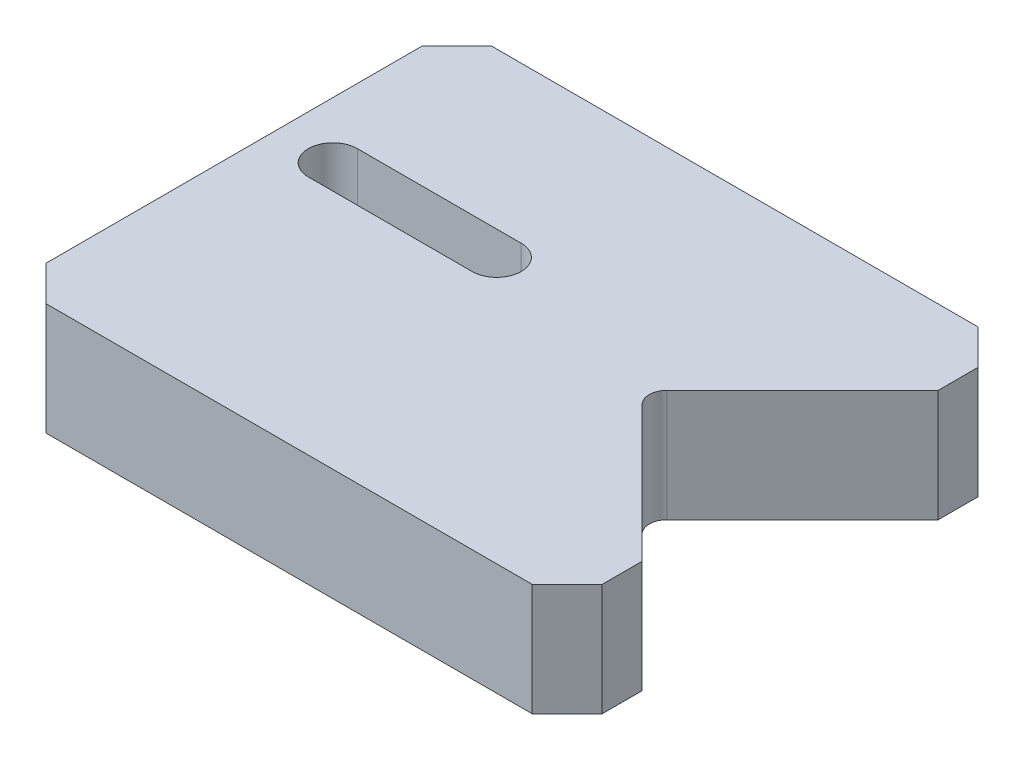
ISO-10303-21;
HEADER;
FILE_DESCRIPTION(('STEP AP214'),'2;1');
FILE_NAME('part.step','',(''),(''),'','','');
FILE_SCHEMA(('AUTOMOTIVE_DESIGN { 1 0 10303 214 1 1 1 1 }'));
ENDSEC;
DATA;
#1=APPLICATION_CONTEXT('core data for automotive mechanical design processes');
#2=APPLICATION_PROTOCOL_DEFINITION('international standard','automotive_design',2000,#1);
#3=PRODUCT_CONTEXT('',#1,'mechanical');
#4=PRODUCT('Part','Part','',(#3));
#5=PRODUCT_RELATED_PRODUCT_CATEGORY('part','',(#4));
#6=PRODUCT_DEFINITION_FORMATION('','',#4);
#7=PRODUCT_DEFINITION_CONTEXT('part definition',#1,'design');
#8=PRODUCT_DEFINITION('design','',#6,#7);
#9=PRODUCT_DEFINITION_SHAPE('','',#8);
#10=(LENGTH_UNIT() NAMED_UNIT(*) SI_UNIT(.MILLI.,.METRE.));
#11=(NAMED_UNIT(*) PLANE_ANGLE_UNIT() SI_UNIT($,.RADIAN.));
#12=(NAMED_UNIT(*) SI_UNIT($,.STERADIAN.) SOLID_ANGLE_UNIT());
#13=UNCERTAINTY_MEASURE_WITH_UNIT(LENGTH_MEASURE(1.E-05),#10,'distance_accuracy_value','');
#14=(GEOMETRIC_REPRESENTATION_CONTEXT(3) GLOBAL_UNCERTAINTY_ASSIGNED_CONTEXT((#13)) GLOBAL_UNIT_ASSIGNED_CONTEXT((#10,
#11,#12)) REPRESENTATION_CONTEXT('',''));
#15=CARTESIAN_POINT('',(0.,0.,0.));
#16=DIRECTION('',(0.,0.,1.));
#17=DIRECTION('',(1.,0.,0.));
#18=AXIS2_PLACEMENT_3D('',#15,#16,#17);
#19=CARTESIAN_POINT('',(17.6784271247462,12.8,0.));
#20=DIRECTION('',(0.,-1.,0.));
#21=DIRECTION('',(0.,0.,-1.));
#22=AXIS2_PLACEMENT_3D('',#19,#20,#21);
#23=PLANE('',#22);
#24=DIRECTION('',(0.707106781186546,0.,-0.707106781186549));
#25=VECTOR('',#24,1.);
#26=CARTESIAN_POINT('',(16.2642135623731,12.8,-1.41421356237312));
#27=LINE('',#26,#25);
#28=CARTESIAN_POINT('',(16.2642135623731,12.8,-1.41421356237311));
#29=VERTEX_POINT('',#28);
#30=CARTESIAN_POINT('',(31.75,12.8,-16.9000000000001));
#31=VERTEX_POINT('',#30);
#32=EDGE_CURVE('E182',#29,#31,#27,.T.);
#33=ORIENTED_EDGE('',*,*,#32,.T.);
#34=DIRECTION('',(0.,0.,-1.));
#35=VECTOR('',#34,1.);
#36=CARTESIAN_POINT('',(31.75,12.8,-21.45));
#37=LINE('',#36,#35);
#38=CARTESIAN_POINT('',(31.75,12.8,-21.45));
#39=VERTEX_POINT('',#38);
#40=EDGE_CURVE('E185',#31,#39,#37,.T.);
#41=ORIENTED_EDGE('',*,*,#40,.T.);
#42=DIRECTION('',(-0.707106781186548,0.,-0.707106781186548));
#43=VECTOR('',#42,1.);
#44=CARTESIAN_POINT('',(27.75,12.8,-25.45));
#45=LINE('',#44,#43);
#46=CARTESIAN_POINT('',(27.75,12.8,-25.45));
#47=VERTEX_POINT('',#46);
#48=EDGE_CURVE('E188',#39,#47,#45,.T.);
#49=ORIENTED_EDGE('',*,*,#48,.T.);
#50=DIRECTION('',(-1.,0.,0.));
#51=VECTOR('',#50,1.);
#52=CARTESIAN_POINT('',(-27.75,12.8,-25.45));
#53=LINE('',#52,#51);
#54=CARTESIAN_POINT('',(-27.75,12.8,-25.45));
#55=VERTEX_POINT('',#54);
#56=EDGE_CURVE('E190',#47,#55,#53,.T.);
#57=ORIENTED_EDGE('',*,*,#56,.T.);
#58=DIRECTION('',(-0.707106781186548,0.,0.707106781186548));
#59=VECTOR('',#58,1.);
#60=CARTESIAN_POINT('',(-31.75,12.8,-21.45));
#61=LINE('',#60,#59);
#62=CARTESIAN_POINT('',(-31.75,12.8,-21.45));
#63=VERTEX_POINT('',#62);
#64=EDGE_CURVE('E192',#55,#63,#61,.T.);
#65=ORIENTED_EDGE('',*,*,#64,.T.);
#66=DIRECTION('',(0.,0.,1.));
#67=VECTOR('',#66,1.);
#68=CARTESIAN_POINT('',(-31.75,12.8,-21.45));
#69=LINE('',#68,#67);
#70=CARTESIAN_POINT('',(-31.75,12.8,21.45));
#71=VERTEX_POINT('',#70);
#72=EDGE_CURVE('E194',#63,#71,#69,.T.);
#73=ORIENTED_EDGE('',*,*,#72,.T.);
#74=DIRECTION('',(0.707106781186548,0.,0.707106781186548));
#75=VECTOR('',#74,1.);
#76=CARTESIAN_POINT('',(-31.75,12.8,21.45));
#77=LINE('',#76,#75);
#78=CARTESIAN_POINT('',(-27.75,12.8,25.45));
#79=VERTEX_POINT('',#78);
#80=EDGE_CURVE('E196',#71,#79,#77,.T.);
#81=ORIENTED_EDGE('',*,*,#80,.T.);
#82=DIRECTION('',(1.,0.,0.));
#83=VECTOR('',#82,1.);
#84=CARTESIAN_POINT('',(-27.75,12.8,25.45));
#85=LINE('',#84,#83);
#86=CARTESIAN_POINT('',(27.75,12.8,25.45));
#87=VERTEX_POINT('',#86);
#88=EDGE_CURVE('E198',#79,#87,#85,.T.);
#89=ORIENTED_EDGE('',*,*,#88,.T.);
#90=DIRECTION('',(0.707106781186548,0.,-0.707106781186548));
#91=VECTOR('',#90,1.);
#92=CARTESIAN_POINT('',(27.75,12.8,25.45));
#93=LINE('',#92,#91);
#94=CARTESIAN_POINT('',(31.75,12.8,21.45));
#95=VERTEX_POINT('',#94);
#96=EDGE_CURVE('E200',#87,#95,#93,.T.);
#97=ORIENTED_EDGE('',*,*,#96,.T.);
#98=DIRECTION('',(0.,0.,-1.));
#99=VECTOR('',#98,1.);
#100=CARTESIAN_POINT('',(31.75,12.8,16.8999999999996));
#101=LINE('',#100,#99);
#102=CARTESIAN_POINT('',(31.75,12.8,16.8999999999996));
#103=VERTEX_POINT('',#102);
#104=EDGE_CURVE('E202',#95,#103,#101,.T.);
#105=ORIENTED_EDGE('',*,*,#104,.T.);
#106=DIRECTION('',(-0.707106781186557,0.,-0.707106781186539));
#107=VECTOR('',#106,1.);
#108=CARTESIAN_POINT('',(16.2642135623731,12.8,1.41421356237309));
#109=LINE('',#108,#107);
#110=CARTESIAN_POINT('',(16.2642135623731,12.8,1.41421356237309));
#111=VERTEX_POINT('',#110);
#112=EDGE_CURVE('E204',#103,#111,#109,.T.);
#113=ORIENTED_EDGE('',*,*,#112,.T.);
#114=CARTESIAN_POINT('',(17.6784271247462,12.8,0.));
#115=DIRECTION('',(0.,-1.,0.));
#116=DIRECTION('',(0.,0.,-1.));
#117=AXIS2_PLACEMENT_3D('',#114,#115,#116);
#118=CIRCLE('',#117,2.);
#119=EDGE_CURVE('E206',#111,#29,#118,.T.);
#120=ORIENTED_EDGE('',*,*,#119,.T.);
#121=EDGE_LOOP('',(#33,#41,#49,#57,#65,#73,#81,#89,#97,#105,#113,#120));
#122=FACE_BOUND('',#121,.T.);
#123=CARTESIAN_POINT('',(-25.3,12.8,-4.85));
#124=DIRECTION('',(0.,1.,0.));
#125=DIRECTION('',(0.,0.,1.));
#126=AXIS2_PLACEMENT_3D('',#123,#124,#125);
#127=CIRCLE('',#126,2.80000000000001);
#128=CARTESIAN_POINT('',(-25.3,12.8,-7.65000000000001));
#129=VERTEX_POINT('',#128);
#130=CARTESIAN_POINT('',(-25.3,12.8,-2.04999999999999));
#131=VERTEX_POINT('',#130);
#132=EDGE_CURVE('E146',#129,#131,#127,.T.);
#133=ORIENTED_EDGE('',*,*,#132,.F.);
#134=DIRECTION('',(-1.,0.,0.));
#135=VECTOR('',#134,1.);
#136=CARTESIAN_POINT('',(-25.3,12.8,-7.65000000000001));
#137=LINE('',#136,#135);
#138=CARTESIAN_POINT('',(-6.59999999999999,12.8,-7.65000000000001));
#139=VERTEX_POINT('',#138);
#140=EDGE_CURVE('E168',#139,#129,#137,.T.);
#141=ORIENTED_EDGE('',*,*,#140,.F.);
#142=CARTESIAN_POINT('',(-6.59999999999999,12.8,-4.85));
#143=DIRECTION('',(0.,1.,0.));
#144=DIRECTION('',(0.,0.,1.));
#145=AXIS2_PLACEMENT_3D('',#142,#143,#144);
#146=CIRCLE('',#145,2.80000000000001);
#147=CARTESIAN_POINT('',(-6.59999999999999,12.8,-2.04999999999999));
#148=VERTEX_POINT('',#147);
#149=EDGE_CURVE('E166',#148,#139,#146,.T.);
#150=ORIENTED_EDGE('',*,*,#149,.F.);
#151=DIRECTION('',(1.,0.,0.));
#152=VECTOR('',#151,1.);
#153=CARTESIAN_POINT('',(-25.3,12.8,-2.04999999999999));
#154=LINE('',#153,#152);
#155=EDGE_CURVE('E154',#131,#148,#154,.T.);
#156=ORIENTED_EDGE('',*,*,#155,.F.);
#157=EDGE_LOOP('',(#133,#141,#150,#156));
#158=FACE_BOUND('',#157,.T.);
#159=ADVANCED_FACE('F33',(#122,#158),#23,.F.);
#160=CARTESIAN_POINT('',(17.6784271247462,0.,0.));
#161=DIRECTION('',(0.,-1.,0.));
#162=DIRECTION('',(0.,0.,-1.));
#163=AXIS2_PLACEMENT_3D('',#160,#161,#162);
#164=PLANE('',#163);
#165=DIRECTION('',(0.707106781186546,0.,-0.707106781186549));
#166=VECTOR('',#165,1.);
#167=CARTESIAN_POINT('',(16.2642135623731,0.,-1.41421356237312));
#168=LINE('',#167,#166);
#169=CARTESIAN_POINT('',(16.2642135623731,0.,-1.41421356237311));
#170=VERTEX_POINT('',#169);
#171=CARTESIAN_POINT('',(31.75,0.,-16.9000000000001));
#172=VERTEX_POINT('',#171);
#173=EDGE_CURVE('E162',#170,#172,#168,.T.);
#174=ORIENTED_EDGE('',*,*,#173,.F.);
#175=CARTESIAN_POINT('',(17.6784271247462,0.,0.));
#176=DIRECTION('',(0.,-1.,0.));
#177=DIRECTION('',(0.,0.,-1.));
#178=AXIS2_PLACEMENT_3D('',#175,#176,#177);
#179=CIRCLE('',#178,2.);
#180=CARTESIAN_POINT('',(16.2642135623731,0.,1.41421356237309));
#181=VERTEX_POINT('',#180);
#182=EDGE_CURVE('E186',#181,#170,#179,.T.);
#183=ORIENTED_EDGE('',*,*,#182,.F.);
#184=DIRECTION('',(-0.707106781186557,0.,-0.707106781186539));
#185=VECTOR('',#184,1.);
#186=CARTESIAN_POINT('',(16.2642135623731,0.,1.41421356237309));
#187=LINE('',#186,#185);
#188=CARTESIAN_POINT('',(31.75,0.,16.8999999999996));
#189=VERTEX_POINT('',#188);
#190=EDGE_CURVE('E229',#189,#181,#187,.T.);
#191=ORIENTED_EDGE('',*,*,#190,.F.);
#192=DIRECTION('',(0.,0.,-1.));
#193=VECTOR('',#192,1.);
#194=CARTESIAN_POINT('',(31.75,0.,16.8999999999996));
#195=LINE('',#194,#193);
#196=CARTESIAN_POINT('',(31.75,0.,21.45));
#197=VERTEX_POINT('',#196);
#198=EDGE_CURVE('E227',#197,#189,#195,.T.);
#199=ORIENTED_EDGE('',*,*,#198,.F.);
#200=DIRECTION('',(0.707106781186548,0.,-0.707106781186548));
#201=VECTOR('',#200,1.);
#202=CARTESIAN_POINT('',(27.75,0.,25.45));
#203=LINE('',#202,#201);
#204=CARTESIAN_POINT('',(27.75,0.,25.45));
#205=VERTEX_POINT('',#204);
#206=EDGE_CURVE('E225',#205,#197,#203,.T.);
#207=ORIENTED_EDGE('',*,*,#206,.F.);
#208=DIRECTION('',(1.,0.,0.));
#209=VECTOR('',#208,1.);
#210=CARTESIAN_POINT('',(-27.75,0.,25.45));
#211=LINE('',#210,#209);
#212=CARTESIAN_POINT('',(-27.75,0.,25.45));
#213=VERTEX_POINT('',#212);
#214=EDGE_CURVE('E223',#213,#205,#211,.T.);
#215=ORIENTED_EDGE('',*,*,#214,.F.);
#216=DIRECTION('',(0.707106781186548,0.,0.707106781186548));
#217=VECTOR('',#216,1.);
#218=CARTESIAN_POINT('',(-31.75,0.,21.45));
#219=LINE('',#218,#217);
#220=CARTESIAN_POINT('',(-31.75,0.,21.45));
#221=VERTEX_POINT('',#220);
#222=EDGE_CURVE('E221',#221,#213,#219,.T.);
#223=ORIENTED_EDGE('',*,*,#222,.F.);
#224=DIRECTION('',(0.,0.,1.));
#225=VECTOR('',#224,1.);
#226=CARTESIAN_POINT('',(-31.75,0.,-21.45));
#227=LINE('',#226,#225);
#228=CARTESIAN_POINT('',(-31.75,0.,-21.45));
#229=VERTEX_POINT('',#228);
#230=EDGE_CURVE('E219',#229,#221,#227,.T.);
#231=ORIENTED_EDGE('',*,*,#230,.F.);
#232=DIRECTION('',(-0.707106781186548,0.,0.707106781186548));
#233=VECTOR('',#232,1.);
#234=CARTESIAN_POINT('',(-31.75,0.,-21.45));
#235=LINE('',#234,#233);
#236=CARTESIAN_POINT('',(-27.75,0.,-25.45));
#237=VERTEX_POINT('',#236);
#238=EDGE_CURVE('E217',#237,#229,#235,.T.);
#239=ORIENTED_EDGE('',*,*,#238,.F.);
#240=DIRECTION('',(-1.,0.,0.));
#241=VECTOR('',#240,1.);
#242=CARTESIAN_POINT('',(-27.75,0.,-25.45));
#243=LINE('',#242,#241);
#244=CARTESIAN_POINT('',(27.75,0.,-25.45));
#245=VERTEX_POINT('',#244);
#246=EDGE_CURVE('E215',#245,#237,#243,.T.);
#247=ORIENTED_EDGE('',*,*,#246,.F.);
#248=DIRECTION('',(-0.707106781186548,0.,-0.707106781186548));
#249=VECTOR('',#248,1.);
#250=CARTESIAN_POINT('',(27.75,0.,-25.45));
#251=LINE('',#250,#249);
#252=CARTESIAN_POINT('',(31.75,0.,-21.45));
#253=VERTEX_POINT('',#252);
#254=EDGE_CURVE('E213',#253,#245,#251,.T.);
#255=ORIENTED_EDGE('',*,*,#254,.F.);
#256=DIRECTION('',(0.,0.,-1.));
#257=VECTOR('',#256,1.);
#258=CARTESIAN_POINT('',(31.75,0.,-21.45));
#259=LINE('',#258,#257);
#260=EDGE_CURVE('E211',#172,#253,#259,.T.);
#261=ORIENTED_EDGE('',*,*,#260,.F.);
#262=EDGE_LOOP('',(#174,#183,#191,#199,#207,#215,#223,#231,#239,#247,#255,#261));
#263=FACE_BOUND('',#262,.T.);
#264=DIRECTION('',(-1.,0.,0.));
#265=VECTOR('',#264,1.);
#266=CARTESIAN_POINT('',(-25.3,0.,-7.65000000000001));
#267=LINE('',#266,#265);
#268=CARTESIAN_POINT('',(-6.59999999999999,0.,-7.65000000000001));
#269=VERTEX_POINT('',#268);
#270=CARTESIAN_POINT('',(-25.3,0.,-7.65000000000001));
#271=VERTEX_POINT('',#270);
#272=EDGE_CURVE('E155',#269,#271,#267,.T.);
#273=ORIENTED_EDGE('',*,*,#272,.T.);
#274=CARTESIAN_POINT('',(-25.3,0.,-4.85));
#275=DIRECTION('',(0.,1.,0.));
#276=DIRECTION('',(0.,0.,1.));
#277=AXIS2_PLACEMENT_3D('',#274,#275,#276);
#278=CIRCLE('',#277,2.80000000000001);
#279=CARTESIAN_POINT('',(-25.3,0.,-2.04999999999999));
#280=VERTEX_POINT('',#279);
#281=EDGE_CURVE('E56',#271,#280,#278,.T.);
#282=ORIENTED_EDGE('',*,*,#281,.T.);
#283=DIRECTION('',(1.,0.,0.));
#284=VECTOR('',#283,1.);
#285=CARTESIAN_POINT('',(-25.3,0.,-2.04999999999999));
#286=LINE('',#285,#284);
#287=CARTESIAN_POINT('',(-6.59999999999999,0.,-2.04999999999999));
#288=VERTEX_POINT('',#287);
#289=EDGE_CURVE('E161',#280,#288,#286,.T.);
#290=ORIENTED_EDGE('',*,*,#289,.T.);
#291=CARTESIAN_POINT('',(-6.59999999999999,0.,-4.85));
#292=DIRECTION('',(0.,1.,0.));
#293=DIRECTION('',(0.,0.,1.));
#294=AXIS2_PLACEMENT_3D('',#291,#292,#293);
#295=CIRCLE('',#294,2.80000000000001);
#296=EDGE_CURVE('E174',#288,#269,#295,.T.);
#297=ORIENTED_EDGE('',*,*,#296,.T.);
#298=EDGE_LOOP('',(#273,#282,#290,#297));
#299=FACE_BOUND('',#298,.T.);
#300=ADVANCED_FACE('F271',(#263,#299),#164,.T.);
#301=CARTESIAN_POINT('',(16.2642135623731,12.8,-1.41421356237312));
#302=DIRECTION('',(-0.707106781186549,0.,-0.707106781186546));
#303=DIRECTION('',(-0.707106781186546,0.,0.707106781186549));
#304=AXIS2_PLACEMENT_3D('',#301,#302,#303);
#305=PLANE('',#304);
#306=ORIENTED_EDGE('',*,*,#173,.T.);
#307=DIRECTION('',(0.,-1.,0.));
#308=VECTOR('',#307,1.);
#309=CARTESIAN_POINT('',(31.75,12.8,-16.9000000000001));
#310=LINE('',#309,#308);
#311=EDGE_CURVE('E11',#31,#172,#310,.T.);
#312=ORIENTED_EDGE('',*,*,#311,.F.);
#313=ORIENTED_EDGE('',*,*,#32,.F.);
#314=DIRECTION('',(0.,-1.,0.));
#315=VECTOR('',#314,1.);
#316=CARTESIAN_POINT('',(16.2642135623731,12.8,-1.41421356237311));
#317=LINE('',#316,#315);
#318=EDGE_CURVE('E208',#29,#170,#317,.T.);
#319=ORIENTED_EDGE('',*,*,#318,.T.);
#320=EDGE_LOOP('',(#306,#312,#313,#319));
#321=FACE_BOUND('',#320,.T.);
#322=ADVANCED_FACE('F35',(#321),#305,.F.);
#323=CARTESIAN_POINT('',(31.75,12.8,-21.45));
#324=DIRECTION('',(-1.,0.,0.));
#325=DIRECTION('',(0.,0.,1.));
#326=AXIS2_PLACEMENT_3D('',#323,#324,#325);
#327=PLANE('',#326);
#328=ORIENTED_EDGE('',*,*,#260,.T.);
#329=DIRECTION('',(0.,-1.,0.));
#330=VECTOR('',#329,1.);
#331=CARTESIAN_POINT('',(31.75,12.8,-21.45));
#332=LINE('',#331,#330);
#333=EDGE_CURVE('E41',#39,#253,#332,.T.);
#334=ORIENTED_EDGE('',*,*,#333,.F.);
#335=ORIENTED_EDGE('',*,*,#40,.F.);
#336=ORIENTED_EDGE('',*,*,#311,.T.);
#337=EDGE_LOOP('',(#328,#334,#335,#336));
#338=FACE_BOUND('',#337,.T.);
#339=ADVANCED_FACE('F288',(#338),#327,.F.);
#340=CARTESIAN_POINT('',(27.75,12.8,-25.45));
#341=DIRECTION('',(-0.707106781186548,0.,0.707106781186548));
#342=DIRECTION('',(0.707106781186548,0.,0.707106781186548));
#343=AXIS2_PLACEMENT_3D('',#340,#341,#342);
#344=PLANE('',#343);
#345=ORIENTED_EDGE('',*,*,#254,.T.);
#346=DIRECTION('',(0.,-1.,0.));
#347=VECTOR('',#346,1.);
#348=CARTESIAN_POINT('',(27.75,12.8,-25.45));
#349=LINE('',#348,#347);
#350=EDGE_CURVE('E258',#47,#245,#349,.T.);
#351=ORIENTED_EDGE('',*,*,#350,.F.);
#352=ORIENTED_EDGE('',*,*,#48,.F.);
#353=ORIENTED_EDGE('',*,*,#333,.T.);
#354=EDGE_LOOP('',(#345,#351,#352,#353));
#355=FACE_BOUND('',#354,.T.);
#356=ADVANCED_FACE('F265',(#355),#344,.F.);
#357=CARTESIAN_POINT('',(-27.75,12.8,-25.45));
#358=DIRECTION('',(0.,0.,1.));
#359=DIRECTION('',(1.,0.,0.));
#360=AXIS2_PLACEMENT_3D('',#357,#358,#359);
#361=PLANE('',#360);
#362=ORIENTED_EDGE('',*,*,#246,.T.);
#363=DIRECTION('',(0.,-1.,0.));
#364=VECTOR('',#363,1.);
#365=CARTESIAN_POINT('',(-27.75,12.8,-25.45));
#366=LINE('',#365,#364);
#367=EDGE_CURVE('E255',#55,#237,#366,.T.);
#368=ORIENTED_EDGE('',*,*,#367,.F.);
#369=ORIENTED_EDGE('',*,*,#56,.F.);
#370=ORIENTED_EDGE('',*,*,#350,.T.);
#371=EDGE_LOOP('',(#362,#368,#369,#370));
#372=FACE_BOUND('',#371,.T.);
#373=ADVANCED_FACE('F277',(#372),#361,.F.);
#374=CARTESIAN_POINT('',(-31.75,12.8,-21.45));
#375=DIRECTION('',(0.707106781186548,0.,0.707106781186548));
#376=DIRECTION('',(0.707106781186548,0.,-0.707106781186548));
#377=AXIS2_PLACEMENT_3D('',#374,#375,#376);
#378=PLANE('',#377);
#379=ORIENTED_EDGE('',*,*,#238,.T.);
#380=DIRECTION('',(0.,-1.,0.));
#381=VECTOR('',#380,1.);
#382=CARTESIAN_POINT('',(-31.75,12.8,-21.45));
#383=LINE('',#382,#381);
#384=EDGE_CURVE('E252',#63,#229,#383,.T.);
#385=ORIENTED_EDGE('',*,*,#384,.F.);
#386=ORIENTED_EDGE('',*,*,#64,.F.);
#387=ORIENTED_EDGE('',*,*,#367,.T.);
#388=EDGE_LOOP('',(#379,#385,#386,#387));
#389=FACE_BOUND('',#388,.T.);
#390=ADVANCED_FACE('F281',(#389),#378,.F.);
#391=CARTESIAN_POINT('',(-31.75,12.8,-21.45));
#392=DIRECTION('',(1.,0.,0.));
#393=DIRECTION('',(0.,0.,-1.));
#394=AXIS2_PLACEMENT_3D('',#391,#392,#393);
#395=PLANE('',#394);
#396=ORIENTED_EDGE('',*,*,#230,.T.);
#397=DIRECTION('',(0.,-1.,0.));
#398=VECTOR('',#397,1.);
#399=CARTESIAN_POINT('',(-31.75,12.8,21.45));
#400=LINE('',#399,#398);
#401=EDGE_CURVE('E249',#71,#221,#400,.T.);
#402=ORIENTED_EDGE('',*,*,#401,.F.);
#403=ORIENTED_EDGE('',*,*,#72,.F.);
#404=ORIENTED_EDGE('',*,*,#384,.T.);
#405=EDGE_LOOP('',(#396,#402,#403,#404));
#406=FACE_BOUND('',#405,.T.);
#407=ADVANCED_FACE('F321',(#406),#395,.F.);
#408=CARTESIAN_POINT('',(-31.75,12.8,21.45));
#409=DIRECTION('',(0.707106781186548,0.,-0.707106781186548));
#410=DIRECTION('',(-0.707106781186548,0.,-0.707106781186548));
#411=AXIS2_PLACEMENT_3D('',#408,#409,#410);
#412=PLANE('',#411);
#413=ORIENTED_EDGE('',*,*,#222,.T.);
#414=DIRECTION('',(0.,-1.,0.));
#415=VECTOR('',#414,1.);
#416=CARTESIAN_POINT('',(-27.75,12.8,25.45));
#417=LINE('',#416,#415);
#418=EDGE_CURVE('E246',#79,#213,#417,.T.);
#419=ORIENTED_EDGE('',*,*,#418,.F.);
#420=ORIENTED_EDGE('',*,*,#80,.F.);
#421=ORIENTED_EDGE('',*,*,#401,.T.);
#422=EDGE_LOOP('',(#413,#419,#420,#421));
#423=FACE_BOUND('',#422,.T.);
#424=ADVANCED_FACE('F319',(#423),#412,.F.);
#425=CARTESIAN_POINT('',(-27.75,12.8,25.45));
#426=DIRECTION('',(0.,0.,-1.));
#427=DIRECTION('',(-1.,0.,0.));
#428=AXIS2_PLACEMENT_3D('',#425,#426,#427);
#429=PLANE('',#428);
#430=ORIENTED_EDGE('',*,*,#214,.T.);
#431=DIRECTION('',(0.,-1.,0.));
#432=VECTOR('',#431,1.);
#433=CARTESIAN_POINT('',(27.75,12.8,25.45));
#434=LINE('',#433,#432);
#435=EDGE_CURVE('E243',#87,#205,#434,.T.);
#436=ORIENTED_EDGE('',*,*,#435,.F.);
#437=ORIENTED_EDGE('',*,*,#88,.F.);
#438=ORIENTED_EDGE('',*,*,#418,.T.);
#439=EDGE_LOOP('',(#430,#436,#437,#438));
#440=FACE_BOUND('',#439,.T.);
#441=ADVANCED_FACE('F315',(#440),#429,.F.);
#442=CARTESIAN_POINT('',(27.75,12.8,25.45));
#443=DIRECTION('',(-0.707106781186548,0.,-0.707106781186548));
#444=DIRECTION('',(-0.707106781186548,0.,0.707106781186548));
#445=AXIS2_PLACEMENT_3D('',#442,#443,#444);
#446=PLANE('',#445);
#447=ORIENTED_EDGE('',*,*,#206,.T.);
#448=DIRECTION('',(0.,-1.,0.));
#449=VECTOR('',#448,1.);
#450=CARTESIAN_POINT('',(31.75,12.8,21.45));
#451=LINE('',#450,#449);
#452=EDGE_CURVE('E240',#95,#197,#451,.T.);
#453=ORIENTED_EDGE('',*,*,#452,.F.);
#454=ORIENTED_EDGE('',*,*,#96,.F.);
#455=ORIENTED_EDGE('',*,*,#435,.T.);
#456=EDGE_LOOP('',(#447,#453,#454,#455));
#457=FACE_BOUND('',#456,.T.);
#458=ADVANCED_FACE('F310',(#457),#446,.F.);
#459=CARTESIAN_POINT('',(31.75,12.8,16.8999999999996));
#460=DIRECTION('',(-1.,0.,0.));
#461=DIRECTION('',(0.,0.,1.));
#462=AXIS2_PLACEMENT_3D('',#459,#460,#461);
#463=PLANE('',#462);
#464=ORIENTED_EDGE('',*,*,#198,.T.);
#465=DIRECTION('',(0.,-1.,0.));
#466=VECTOR('',#465,1.);
#467=CARTESIAN_POINT('',(31.75,12.8,16.8999999999996));
#468=LINE('',#467,#466);
#469=EDGE_CURVE('E237',#103,#189,#468,.T.);
#470=ORIENTED_EDGE('',*,*,#469,.F.);
#471=ORIENTED_EDGE('',*,*,#104,.F.);
#472=ORIENTED_EDGE('',*,*,#452,.T.);
#473=EDGE_LOOP('',(#464,#470,#471,#472));
#474=FACE_BOUND('',#473,.T.);
#475=ADVANCED_FACE('F304',(#474),#463,.F.);
#476=CARTESIAN_POINT('',(16.2642135623731,12.8,1.41421356237309));
#477=DIRECTION('',(-0.707106781186539,0.,0.707106781186556));
#478=DIRECTION('',(0.707106781186556,0.,0.707106781186539));
#479=AXIS2_PLACEMENT_3D('',#476,#477,#478);
#480=PLANE('',#479);
#481=ORIENTED_EDGE('',*,*,#190,.T.);
#482=DIRECTION('',(0.,-1.,0.));
#483=VECTOR('',#482,1.);
#484=CARTESIAN_POINT('',(16.2642135623731,12.8,1.41421356237309));
#485=LINE('',#484,#483);
#486=EDGE_CURVE('E234',#111,#181,#485,.T.);
#487=ORIENTED_EDGE('',*,*,#486,.F.);
#488=ORIENTED_EDGE('',*,*,#112,.F.);
#489=ORIENTED_EDGE('',*,*,#469,.T.);
#490=EDGE_LOOP('',(#481,#487,#488,#489));
#491=FACE_BOUND('',#490,.T.);
#492=ADVANCED_FACE('F300',(#491),#480,.F.);
#493=CARTESIAN_POINT('',(17.6784271247462,12.8,0.));
#494=DIRECTION('',(0.,-1.,0.));
#495=DIRECTION('',(0.,0.,-1.));
#496=AXIS2_PLACEMENT_3D('',#493,#494,#495);
#497=CYLINDRICAL_SURFACE('',#496,2.);
#498=ORIENTED_EDGE('',*,*,#182,.T.);
#499=ORIENTED_EDGE('',*,*,#318,.F.);
#500=ORIENTED_EDGE('',*,*,#119,.F.);
#501=ORIENTED_EDGE('',*,*,#486,.T.);
#502=EDGE_LOOP('',(#498,#499,#500,#501));
#503=FACE_BOUND('',#502,.T.);
#504=ADVANCED_FACE('F295',(#503),#497,.F.);
#505=CARTESIAN_POINT('',(-25.3,12.8,-4.85));
#506=DIRECTION('',(0.,-1.,0.));
#507=DIRECTION('',(0.,0.,-1.));
#508=AXIS2_PLACEMENT_3D('',#505,#506,#507);
#509=CYLINDRICAL_SURFACE('',#508,2.80000000000001);
#510=ORIENTED_EDGE('',*,*,#281,.F.);
#511=DIRECTION('',(0.,-1.,0.));
#512=VECTOR('',#511,1.);
#513=CARTESIAN_POINT('',(-25.3,12.8,-7.65000000000001));
#514=LINE('',#513,#512);
#515=EDGE_CURVE('E150',#129,#271,#514,.T.);
#516=ORIENTED_EDGE('',*,*,#515,.F.);
#517=ORIENTED_EDGE('',*,*,#132,.T.);
#518=DIRECTION('',(0.,-1.,0.));
#519=VECTOR('',#518,1.);
#520=CARTESIAN_POINT('',(-25.3,12.8,-2.04999999999999));
#521=LINE('',#520,#519);
#522=EDGE_CURVE('E149',#131,#280,#521,.T.);
#523=ORIENTED_EDGE('',*,*,#522,.T.);
#524=EDGE_LOOP('',(#510,#516,#517,#523));
#525=FACE_BOUND('',#524,.T.);
#526=ADVANCED_FACE('F148',(#525),#509,.F.);
#527=CARTESIAN_POINT('',(-25.3,12.8,-2.04999999999999));
#528=DIRECTION('',(0.,0.,-1.));
#529=DIRECTION('',(-1.,0.,0.));
#530=AXIS2_PLACEMENT_3D('',#527,#528,#529);
#531=PLANE('',#530);
#532=ORIENTED_EDGE('',*,*,#289,.F.);
#533=ORIENTED_EDGE('',*,*,#522,.F.);
#534=ORIENTED_EDGE('',*,*,#155,.T.);
#535=DIRECTION('',(0.,-1.,0.));
#536=VECTOR('',#535,1.);
#537=CARTESIAN_POINT('',(-6.59999999999999,12.8,-2.04999999999999));
#538=LINE('',#537,#536);
#539=EDGE_CURVE('E163',#148,#288,#538,.T.);
#540=ORIENTED_EDGE('',*,*,#539,.T.);
#541=EDGE_LOOP('',(#532,#533,#534,#540));
#542=FACE_BOUND('',#541,.T.);
#543=ADVANCED_FACE('F158',(#542),#531,.T.);
#544=CARTESIAN_POINT('',(-6.59999999999999,12.8,-4.85));
#545=DIRECTION('',(0.,-1.,0.));
#546=DIRECTION('',(0.,0.,-1.));
#547=AXIS2_PLACEMENT_3D('',#544,#545,#546);
#548=CYLINDRICAL_SURFACE('',#547,2.80000000000001);
#549=ORIENTED_EDGE('',*,*,#296,.F.);
#550=ORIENTED_EDGE('',*,*,#539,.F.);
#551=ORIENTED_EDGE('',*,*,#149,.T.);
#552=DIRECTION('',(0.,-1.,0.));
#553=VECTOR('',#552,1.);
#554=CARTESIAN_POINT('',(-6.59999999999999,12.8,-7.65000000000001));
#555=LINE('',#554,#553);
#556=EDGE_CURVE('E48',#139,#269,#555,.T.);
#557=ORIENTED_EDGE('',*,*,#556,.T.);
#558=EDGE_LOOP('',(#549,#550,#551,#557));
#559=FACE_BOUND('',#558,.T.);
#560=ADVANCED_FACE('F379',(#559),#548,.F.);
#561=CARTESIAN_POINT('',(-25.3,12.8,-7.65000000000001));
#562=DIRECTION('',(0.,0.,1.));
#563=DIRECTION('',(1.,0.,0.));
#564=AXIS2_PLACEMENT_3D('',#561,#562,#563);
#565=PLANE('',#564);
#566=ORIENTED_EDGE('',*,*,#272,.F.);
#567=ORIENTED_EDGE('',*,*,#556,.F.);
#568=ORIENTED_EDGE('',*,*,#140,.T.);
#569=ORIENTED_EDGE('',*,*,#515,.T.);
#570=EDGE_LOOP('',(#566,#567,#568,#569));
#571=FACE_BOUND('',#570,.T.);
#572=ADVANCED_FACE('F385',(#571),#565,.T.);
#573=CLOSED_SHELL('',(#159,#300,#322,#339,#356,#373,#390,#407,#424,#441,#458,#475,#492,#504,
#526,#543,#560,#572));
#574=MANIFOLD_SOLID_BREP('B2',#573);
#575=ADVANCED_BREP_SHAPE_REPRESENTATION('',(#18,#574),#14);
#576=SHAPE_DEFINITION_REPRESENTATION(#9,#575);
ENDSEC;
END-ISO-10303-21;
